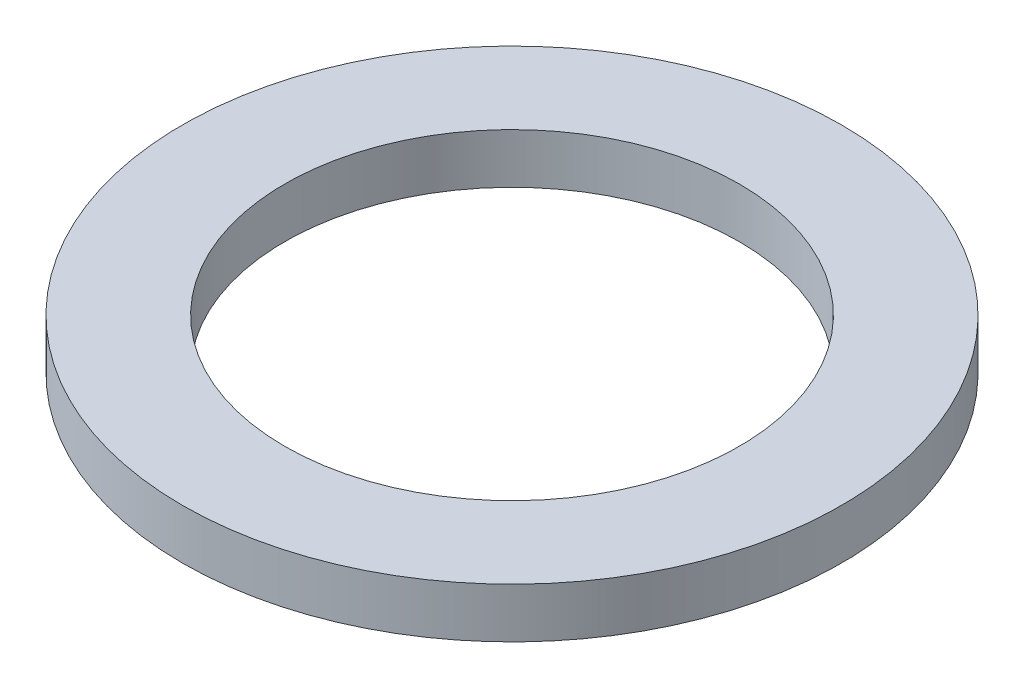
ISO-10303-21;
HEADER;
FILE_DESCRIPTION(('STEP AP214'),'2;1');
FILE_NAME('part.step','',(''),(''),'','','');
FILE_SCHEMA(('AUTOMOTIVE_DESIGN { 1 0 10303 214 1 1 1 1 }'));
ENDSEC;
DATA;
#1=APPLICATION_CONTEXT('core data for automotive mechanical design processes');
#2=APPLICATION_PROTOCOL_DEFINITION('international standard','automotive_design',2000,#1);
#3=PRODUCT_CONTEXT('',#1,'mechanical');
#4=PRODUCT('Part','Part','',(#3));
#5=PRODUCT_RELATED_PRODUCT_CATEGORY('part','',(#4));
#6=PRODUCT_DEFINITION_FORMATION('','',#4);
#7=PRODUCT_DEFINITION_CONTEXT('part definition',#1,'design');
#8=PRODUCT_DEFINITION('design','',#6,#7);
#9=PRODUCT_DEFINITION_SHAPE('','',#8);
#10=(LENGTH_UNIT() NAMED_UNIT(*) SI_UNIT(.MILLI.,.METRE.));
#11=(NAMED_UNIT(*) PLANE_ANGLE_UNIT() SI_UNIT($,.RADIAN.));
#12=(NAMED_UNIT(*) SI_UNIT($,.STERADIAN.) SOLID_ANGLE_UNIT());
#13=UNCERTAINTY_MEASURE_WITH_UNIT(LENGTH_MEASURE(1.E-05),#10,'distance_accuracy_value','');
#14=(GEOMETRIC_REPRESENTATION_CONTEXT(3) GLOBAL_UNCERTAINTY_ASSIGNED_CONTEXT((#13)) GLOBAL_UNIT_ASSIGNED_CONTEXT((#10,
#11,#12)) REPRESENTATION_CONTEXT('',''));
#15=CARTESIAN_POINT('',(0.,0.,0.));
#16=DIRECTION('',(0.,0.,1.));
#17=DIRECTION('',(1.,0.,0.));
#18=AXIS2_PLACEMENT_3D('',#15,#16,#17);
#19=CARTESIAN_POINT('',(0.,11.,0.));
#20=DIRECTION('',(0.,-1.,0.));
#21=DIRECTION('',(0.,0.,-1.));
#22=AXIS2_PLACEMENT_3D('',#19,#20,#21);
#23=CYLINDRICAL_SURFACE('',#22,72.5);
#24=CARTESIAN_POINT('',(0.,11.,0.));
#25=DIRECTION('',(0.,1.,0.));
#26=DIRECTION('',(0.,0.,1.));
#27=AXIS2_PLACEMENT_3D('',#24,#25,#26);
#28=CIRCLE('',#27,72.5);
#29=CARTESIAN_POINT('',(0.,11.,72.5));
#30=VERTEX_POINT('',#29);
#31=EDGE_CURVE('E10',#30,#30,#28,.T.);
#32=ORIENTED_EDGE('',*,*,#31,.F.);
#33=EDGE_LOOP('',(#32));
#34=FACE_BOUND('',#33,.T.);
#35=CARTESIAN_POINT('',(0.,0.,0.));
#36=DIRECTION('',(0.,1.,0.));
#37=DIRECTION('',(0.,0.,1.));
#38=AXIS2_PLACEMENT_3D('',#35,#36,#37);
#39=CIRCLE('',#38,72.5);
#40=CARTESIAN_POINT('',(0.,0.,72.5));
#41=VERTEX_POINT('',#40);
#42=EDGE_CURVE('E37',#41,#41,#39,.T.);
#43=ORIENTED_EDGE('',*,*,#42,.T.);
#44=EDGE_LOOP('',(#43));
#45=FACE_BOUND('',#44,.T.);
#46=ADVANCED_FACE('F40',(#34,#45),#23,.T.);
#47=CARTESIAN_POINT('',(0.,11.,0.));
#48=DIRECTION('',(0.,1.,0.));
#49=DIRECTION('',(0.,0.,1.));
#50=AXIS2_PLACEMENT_3D('',#47,#48,#49);
#51=PLANE('',#50);
#52=CARTESIAN_POINT('',(0.,11.,0.));
#53=DIRECTION('',(0.,1.,0.));
#54=DIRECTION('',(0.,0.,1.));
#55=AXIS2_PLACEMENT_3D('',#52,#53,#54);
#56=CIRCLE('',#55,50.);
#57=CARTESIAN_POINT('',(0.,11.,50.));
#58=VERTEX_POINT('',#57);
#59=EDGE_CURVE('E50',#58,#58,#56,.T.);
#60=ORIENTED_EDGE('',*,*,#59,.F.);
#61=EDGE_LOOP('',(#60));
#62=FACE_BOUND('',#61,.T.);
#63=ORIENTED_EDGE('',*,*,#31,.T.);
#64=EDGE_LOOP('',(#63));
#65=FACE_BOUND('',#64,.T.);
#66=ADVANCED_FACE('F59',(#62,#65),#51,.T.);
#67=CARTESIAN_POINT('',(0.,0.,0.));
#68=DIRECTION('',(0.,1.,0.));
#69=DIRECTION('',(0.,0.,1.));
#70=AXIS2_PLACEMENT_3D('',#67,#68,#69);
#71=PLANE('',#70);
#72=CARTESIAN_POINT('',(0.,0.,0.));
#73=DIRECTION('',(0.,1.,0.));
#74=DIRECTION('',(0.,0.,1.));
#75=AXIS2_PLACEMENT_3D('',#72,#73,#74);
#76=CIRCLE('',#75,50.);
#77=CARTESIAN_POINT('',(0.,0.,50.));
#78=VERTEX_POINT('',#77);
#79=EDGE_CURVE('E47',#78,#78,#76,.T.);
#80=ORIENTED_EDGE('',*,*,#79,.T.);
#81=EDGE_LOOP('',(#80));
#82=FACE_BOUND('',#81,.T.);
#83=ORIENTED_EDGE('',*,*,#42,.F.);
#84=EDGE_LOOP('',(#83));
#85=FACE_BOUND('',#84,.T.);
#86=ADVANCED_FACE('F58',(#82,#85),#71,.F.);
#87=CARTESIAN_POINT('',(0.,11.,0.));
#88=DIRECTION('',(0.,-1.,0.));
#89=DIRECTION('',(0.,0.,-1.));
#90=AXIS2_PLACEMENT_3D('',#87,#88,#89);
#91=CYLINDRICAL_SURFACE('',#90,50.);
#92=ORIENTED_EDGE('',*,*,#59,.T.);
#93=EDGE_LOOP('',(#92));
#94=FACE_BOUND('',#93,.T.);
#95=ORIENTED_EDGE('',*,*,#79,.F.);
#96=EDGE_LOOP('',(#95));
#97=FACE_BOUND('',#96,.T.);
#98=ADVANCED_FACE('F54',(#94,#97),#91,.F.);
#99=CLOSED_SHELL('',(#46,#66,#86,#98));
#100=MANIFOLD_SOLID_BREP('B2',#99);
#101=ADVANCED_BREP_SHAPE_REPRESENTATION('',(#18,#100),#14);
#102=SHAPE_DEFINITION_REPRESENTATION(#9,#101);
ENDSEC;
END-ISO-10303-21;
